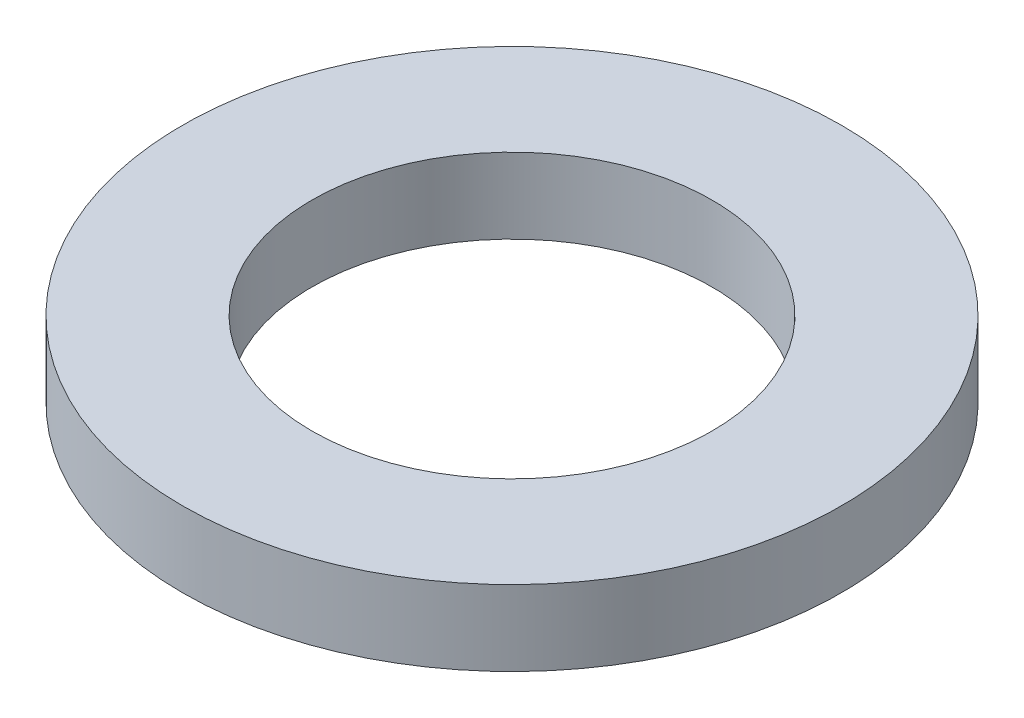
ISO-10303-21;
HEADER;
FILE_DESCRIPTION(('STEP AP214'),'2;1');
FILE_NAME('part.step','',(''),(''),'','','');
FILE_SCHEMA(('AUTOMOTIVE_DESIGN { 1 0 10303 214 1 1 1 1 }'));
ENDSEC;
DATA;
#1=APPLICATION_CONTEXT('core data for automotive mechanical design processes');
#2=APPLICATION_PROTOCOL_DEFINITION('international standard','automotive_design',2000,#1);
#3=PRODUCT_CONTEXT('',#1,'mechanical');
#4=PRODUCT('Part','Part','',(#3));
#5=PRODUCT_RELATED_PRODUCT_CATEGORY('part','',(#4));
#6=PRODUCT_DEFINITION_FORMATION('','',#4);
#7=PRODUCT_DEFINITION_CONTEXT('part definition',#1,'design');
#8=PRODUCT_DEFINITION('design','',#6,#7);
#9=PRODUCT_DEFINITION_SHAPE('','',#8);
#10=(LENGTH_UNIT() NAMED_UNIT(*) SI_UNIT(.MILLI.,.METRE.));
#11=(NAMED_UNIT(*) PLANE_ANGLE_UNIT() SI_UNIT($,.RADIAN.));
#12=(NAMED_UNIT(*) SI_UNIT($,.STERADIAN.) SOLID_ANGLE_UNIT());
#13=UNCERTAINTY_MEASURE_WITH_UNIT(LENGTH_MEASURE(1.E-05),#10,'distance_accuracy_value','');
#14=(GEOMETRIC_REPRESENTATION_CONTEXT(3) GLOBAL_UNCERTAINTY_ASSIGNED_CONTEXT((#13)) GLOBAL_UNIT_ASSIGNED_CONTEXT((#10,
#11,#12)) REPRESENTATION_CONTEXT('',''));
#15=CARTESIAN_POINT('',(0.,0.,0.));
#16=DIRECTION('',(0.,0.,1.));
#17=DIRECTION('',(1.,0.,0.));
#18=AXIS2_PLACEMENT_3D('',#15,#16,#17);
#19=CARTESIAN_POINT('',(0.,16.,0.));
#20=DIRECTION('',(0.,-1.,0.));
#21=DIRECTION('',(0.,0.,-1.));
#22=AXIS2_PLACEMENT_3D('',#19,#20,#21);
#23=CYLINDRICAL_SURFACE('',#22,70.);
#24=CARTESIAN_POINT('',(0.,16.,0.));
#25=DIRECTION('',(0.,1.,0.));
#26=DIRECTION('',(0.,0.,1.));
#27=AXIS2_PLACEMENT_3D('',#24,#25,#26);
#28=CIRCLE('',#27,70.);
#29=CARTESIAN_POINT('',(0.,16.,70.));
#30=VERTEX_POINT('',#29);
#31=EDGE_CURVE('E10',#30,#30,#28,.T.);
#32=ORIENTED_EDGE('',*,*,#31,.F.);
#33=EDGE_LOOP('',(#32));
#34=FACE_BOUND('',#33,.T.);
#35=CARTESIAN_POINT('',(0.,0.,0.));
#36=DIRECTION('',(0.,1.,0.));
#37=DIRECTION('',(0.,0.,1.));
#38=AXIS2_PLACEMENT_3D('',#35,#36,#37);
#39=CIRCLE('',#38,70.);
#40=CARTESIAN_POINT('',(0.,0.,70.));
#41=VERTEX_POINT('',#40);
#42=EDGE_CURVE('E37',#41,#41,#39,.T.);
#43=ORIENTED_EDGE('',*,*,#42,.T.);
#44=EDGE_LOOP('',(#43));
#45=FACE_BOUND('',#44,.T.);
#46=ADVANCED_FACE('F40',(#34,#45),#23,.T.);
#47=CARTESIAN_POINT('',(0.,16.,0.));
#48=DIRECTION('',(0.,1.,0.));
#49=DIRECTION('',(0.,0.,1.));
#50=AXIS2_PLACEMENT_3D('',#47,#48,#49);
#51=PLANE('',#50);
#52=CARTESIAN_POINT('',(0.,16.,0.));
#53=DIRECTION('',(0.,1.,0.));
#54=DIRECTION('',(0.,0.,1.));
#55=AXIS2_PLACEMENT_3D('',#52,#53,#54);
#56=CIRCLE('',#55,42.5);
#57=CARTESIAN_POINT('',(0.,16.,42.5));
#58=VERTEX_POINT('',#57);
#59=EDGE_CURVE('E50',#58,#58,#56,.T.);
#60=ORIENTED_EDGE('',*,*,#59,.F.);
#61=EDGE_LOOP('',(#60));
#62=FACE_BOUND('',#61,.T.);
#63=ORIENTED_EDGE('',*,*,#31,.T.);
#64=EDGE_LOOP('',(#63));
#65=FACE_BOUND('',#64,.T.);
#66=ADVANCED_FACE('F59',(#62,#65),#51,.T.);
#67=CARTESIAN_POINT('',(0.,0.,0.));
#68=DIRECTION('',(0.,1.,0.));
#69=DIRECTION('',(0.,0.,1.));
#70=AXIS2_PLACEMENT_3D('',#67,#68,#69);
#71=PLANE('',#70);
#72=CARTESIAN_POINT('',(0.,0.,0.));
#73=DIRECTION('',(0.,1.,0.));
#74=DIRECTION('',(0.,0.,1.));
#75=AXIS2_PLACEMENT_3D('',#72,#73,#74);
#76=CIRCLE('',#75,42.5);
#77=CARTESIAN_POINT('',(0.,0.,42.5));
#78=VERTEX_POINT('',#77);
#79=EDGE_CURVE('E47',#78,#78,#76,.T.);
#80=ORIENTED_EDGE('',*,*,#79,.T.);
#81=EDGE_LOOP('',(#80));
#82=FACE_BOUND('',#81,.T.);
#83=ORIENTED_EDGE('',*,*,#42,.F.);
#84=EDGE_LOOP('',(#83));
#85=FACE_BOUND('',#84,.T.);
#86=ADVANCED_FACE('F58',(#82,#85),#71,.F.);
#87=CARTESIAN_POINT('',(0.,16.,0.));
#88=DIRECTION('',(0.,-1.,0.));
#89=DIRECTION('',(0.,0.,-1.));
#90=AXIS2_PLACEMENT_3D('',#87,#88,#89);
#91=CYLINDRICAL_SURFACE('',#90,42.5);
#92=ORIENTED_EDGE('',*,*,#59,.T.);
#93=EDGE_LOOP('',(#92));
#94=FACE_BOUND('',#93,.T.);
#95=ORIENTED_EDGE('',*,*,#79,.F.);
#96=EDGE_LOOP('',(#95));
#97=FACE_BOUND('',#96,.T.);
#98=ADVANCED_FACE('F54',(#94,#97),#91,.F.);
#99=CLOSED_SHELL('',(#46,#66,#86,#98));
#100=MANIFOLD_SOLID_BREP('B2',#99);
#101=ADVANCED_BREP_SHAPE_REPRESENTATION('',(#18,#100),#14);
#102=SHAPE_DEFINITION_REPRESENTATION(#9,#101);
ENDSEC;
END-ISO-10303-21;
